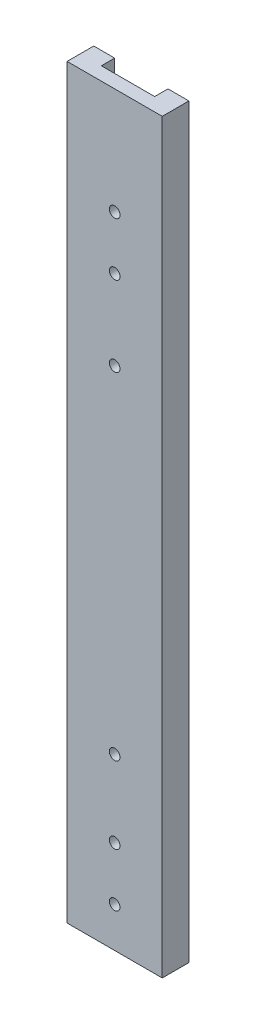
ISO-10303-21;
HEADER;
FILE_DESCRIPTION(('STEP AP214'),'2;1');
FILE_NAME('part.step','',(''),(''),'','','');
FILE_SCHEMA(('AUTOMOTIVE_DESIGN { 1 0 10303 214 1 1 1 1 }'));
ENDSEC;
DATA;
#1=APPLICATION_CONTEXT('core data for automotive mechanical design processes');
#2=APPLICATION_PROTOCOL_DEFINITION('international standard','automotive_design',2000,#1);
#3=PRODUCT_CONTEXT('',#1,'mechanical');
#4=PRODUCT('Part','Part','',(#3));
#5=PRODUCT_RELATED_PRODUCT_CATEGORY('part','',(#4));
#6=PRODUCT_DEFINITION_FORMATION('','',#4);
#7=PRODUCT_DEFINITION_CONTEXT('part definition',#1,'design');
#8=PRODUCT_DEFINITION('design','',#6,#7);
#9=PRODUCT_DEFINITION_SHAPE('','',#8);
#10=(LENGTH_UNIT() NAMED_UNIT(*) SI_UNIT(.MILLI.,.METRE.));
#11=(NAMED_UNIT(*) PLANE_ANGLE_UNIT() SI_UNIT($,.RADIAN.));
#12=(NAMED_UNIT(*) SI_UNIT($,.STERADIAN.) SOLID_ANGLE_UNIT());
#13=UNCERTAINTY_MEASURE_WITH_UNIT(LENGTH_MEASURE(1.E-05),#10,'distance_accuracy_value','');
#14=(GEOMETRIC_REPRESENTATION_CONTEXT(3) GLOBAL_UNCERTAINTY_ASSIGNED_CONTEXT((#13)) GLOBAL_UNIT_ASSIGNED_CONTEXT((#10,
#11,#12)) REPRESENTATION_CONTEXT('',''));
#15=CARTESIAN_POINT('',(0.,0.,0.));
#16=DIRECTION('',(0.,0.,1.));
#17=DIRECTION('',(1.,0.,0.));
#18=AXIS2_PLACEMENT_3D('',#15,#16,#17);
#19=CARTESIAN_POINT('',(0.,0.,0.));
#20=DIRECTION('',(0.,0.,-1.));
#21=DIRECTION('',(-1.,0.,0.));
#22=AXIS2_PLACEMENT_3D('',#19,#20,#21);
#23=PLANE('',#22);
#24=DIRECTION('',(0.,-1.,0.));
#25=VECTOR('',#24,1.);
#26=CARTESIAN_POINT('',(35.3695,0.,0.));
#27=LINE('',#26,#25);
#28=CARTESIAN_POINT('',(35.3695,355.6,0.));
#29=VERTEX_POINT('',#28);
#30=CARTESIAN_POINT('',(35.3695,0.,0.));
#31=VERTEX_POINT('',#30);
#32=EDGE_CURVE('E112',#29,#31,#27,.T.);
#33=ORIENTED_EDGE('',*,*,#32,.F.);
#34=DIRECTION('',(-1.,0.,0.));
#35=VECTOR('',#34,1.);
#36=CARTESIAN_POINT('',(0.,355.6,0.));
#37=LINE('',#36,#35);
#38=CARTESIAN_POINT('',(45.339,355.6,0.));
#39=VERTEX_POINT('',#38);
#40=EDGE_CURVE('E145',#39,#29,#37,.T.);
#41=ORIENTED_EDGE('',*,*,#40,.F.);
#42=DIRECTION('',(0.,1.,0.));
#43=VECTOR('',#42,1.);
#44=CARTESIAN_POINT('',(45.339,0.,0.));
#45=LINE('',#44,#43);
#46=CARTESIAN_POINT('',(45.339,0.,0.));
#47=VERTEX_POINT('',#46);
#48=EDGE_CURVE('E156',#47,#39,#45,.T.);
#49=ORIENTED_EDGE('',*,*,#48,.F.);
#50=DIRECTION('',(1.,0.,0.));
#51=VECTOR('',#50,1.);
#52=CARTESIAN_POINT('',(0.,0.,0.));
#53=LINE('',#52,#51);
#54=EDGE_CURVE('E153',#31,#47,#53,.T.);
#55=ORIENTED_EDGE('',*,*,#54,.F.);
#56=EDGE_LOOP('',(#33,#41,#49,#55));
#57=FACE_BOUND('',#56,.T.);
#58=ADVANCED_FACE('F33',(#57),#23,.T.);
#59=CARTESIAN_POINT('',(0.,0.,12.7));
#60=DIRECTION('',(1.,0.,0.));
#61=DIRECTION('',(0.,0.,-1.));
#62=AXIS2_PLACEMENT_3D('',#59,#60,#61);
#63=PLANE('',#62);
#64=DIRECTION('',(0.,-1.,0.));
#65=VECTOR('',#64,1.);
#66=CARTESIAN_POINT('',(0.,0.,0.));
#67=LINE('',#66,#65);
#68=CARTESIAN_POINT('',(0.,355.6,0.));
#69=VERTEX_POINT('',#68);
#70=CARTESIAN_POINT('',(0.,0.,0.));
#71=VERTEX_POINT('',#70);
#72=EDGE_CURVE('E139',#69,#71,#67,.T.);
#73=ORIENTED_EDGE('',*,*,#72,.T.);
#74=DIRECTION('',(0.,0.,-1.));
#75=VECTOR('',#74,1.);
#76=CARTESIAN_POINT('',(0.,0.,12.7));
#77=LINE('',#76,#75);
#78=CARTESIAN_POINT('',(0.,0.,12.7));
#79=VERTEX_POINT('',#78);
#80=EDGE_CURVE('E11',#79,#71,#77,.T.);
#81=ORIENTED_EDGE('',*,*,#80,.F.);
#82=DIRECTION('',(0.,-1.,0.));
#83=VECTOR('',#82,1.);
#84=CARTESIAN_POINT('',(0.,0.,12.7));
#85=LINE('',#84,#83);
#86=CARTESIAN_POINT('',(0.,355.6,12.7));
#87=VERTEX_POINT('',#86);
#88=EDGE_CURVE('E143',#87,#79,#85,.T.);
#89=ORIENTED_EDGE('',*,*,#88,.F.);
#90=DIRECTION('',(0.,0.,-1.));
#91=VECTOR('',#90,1.);
#92=CARTESIAN_POINT('',(0.,355.6,12.7));
#93=LINE('',#92,#91);
#94=EDGE_CURVE('E150',#87,#69,#93,.T.);
#95=ORIENTED_EDGE('',*,*,#94,.T.);
#96=EDGE_LOOP('',(#73,#81,#89,#95));
#97=FACE_BOUND('',#96,.T.);
#98=ADVANCED_FACE('F35',(#97),#63,.F.);
#99=CARTESIAN_POINT('',(0.,0.,12.7));
#100=DIRECTION('',(0.,1.,0.));
#101=DIRECTION('',(0.,0.,1.));
#102=AXIS2_PLACEMENT_3D('',#99,#100,#101);
#103=PLANE('',#102);
#104=DIRECTION('',(-1.,0.,0.));
#105=VECTOR('',#104,1.);
#106=CARTESIAN_POINT('',(9.9695,0.,6.35));
#107=LINE('',#106,#105);
#108=CARTESIAN_POINT('',(35.3695,0.,6.35));
#109=VERTEX_POINT('',#108);
#110=CARTESIAN_POINT('',(9.9695,0.,6.35));
#111=VERTEX_POINT('',#110);
#112=EDGE_CURVE('E121',#109,#111,#107,.T.);
#113=ORIENTED_EDGE('',*,*,#112,.F.);
#114=DIRECTION('',(0.,0.,-1.));
#115=VECTOR('',#114,1.);
#116=CARTESIAN_POINT('',(35.3695,0.,6.35));
#117=LINE('',#116,#115);
#118=EDGE_CURVE('E106',#109,#31,#117,.T.);
#119=ORIENTED_EDGE('',*,*,#118,.T.);
#120=ORIENTED_EDGE('',*,*,#54,.T.);
#121=DIRECTION('',(0.,0.,-1.));
#122=VECTOR('',#121,1.);
#123=CARTESIAN_POINT('',(45.339,0.,12.7));
#124=LINE('',#123,#122);
#125=CARTESIAN_POINT('',(45.339,0.,12.7));
#126=VERTEX_POINT('',#125);
#127=EDGE_CURVE('E41',#126,#47,#124,.T.);
#128=ORIENTED_EDGE('',*,*,#127,.F.);
#129=DIRECTION('',(1.,0.,0.));
#130=VECTOR('',#129,1.);
#131=CARTESIAN_POINT('',(0.,0.,12.7));
#132=LINE('',#131,#130);
#133=EDGE_CURVE('E85',#79,#126,#132,.T.);
#134=ORIENTED_EDGE('',*,*,#133,.F.);
#135=ORIENTED_EDGE('',*,*,#80,.T.);
#136=CARTESIAN_POINT('',(9.9695,0.,0.));
#137=VERTEX_POINT('',#136);
#138=EDGE_CURVE('E154',#71,#137,#53,.T.);
#139=ORIENTED_EDGE('',*,*,#138,.T.);
#140=DIRECTION('',(0.,0.,-1.));
#141=VECTOR('',#140,1.);
#142=CARTESIAN_POINT('',(9.9695,0.,6.35));
#143=LINE('',#142,#141);
#144=EDGE_CURVE('E48',#111,#137,#143,.T.);
#145=ORIENTED_EDGE('',*,*,#144,.F.);
#146=EDGE_LOOP('',(#113,#119,#120,#128,#134,#135,#139,#145));
#147=FACE_BOUND('',#146,.T.);
#148=ADVANCED_FACE('F126',(#147),#103,.F.);
#149=CARTESIAN_POINT('',(45.339,0.,12.7));
#150=DIRECTION('',(-1.,0.,0.));
#151=DIRECTION('',(0.,0.,1.));
#152=AXIS2_PLACEMENT_3D('',#149,#150,#151);
#153=PLANE('',#152);
#154=ORIENTED_EDGE('',*,*,#48,.T.);
#155=DIRECTION('',(0.,0.,-1.));
#156=VECTOR('',#155,1.);
#157=CARTESIAN_POINT('',(45.339,355.6,12.7));
#158=LINE('',#157,#156);
#159=CARTESIAN_POINT('',(45.339,355.6,12.7));
#160=VERTEX_POINT('',#159);
#161=EDGE_CURVE('E161',#160,#39,#158,.T.);
#162=ORIENTED_EDGE('',*,*,#161,.F.);
#163=DIRECTION('',(0.,1.,0.));
#164=VECTOR('',#163,1.);
#165=CARTESIAN_POINT('',(45.339,0.,12.7));
#166=LINE('',#165,#164);
#167=EDGE_CURVE('E147',#126,#160,#166,.T.);
#168=ORIENTED_EDGE('',*,*,#167,.F.);
#169=ORIENTED_EDGE('',*,*,#127,.T.);
#170=EDGE_LOOP('',(#154,#162,#168,#169));
#171=FACE_BOUND('',#170,.T.);
#172=ADVANCED_FACE('F167',(#171),#153,.F.);
#173=CARTESIAN_POINT('',(0.,355.6,12.7));
#174=DIRECTION('',(0.,-1.,0.));
#175=DIRECTION('',(0.,0.,-1.));
#176=AXIS2_PLACEMENT_3D('',#173,#174,#175);
#177=PLANE('',#176);
#178=ORIENTED_EDGE('',*,*,#40,.T.);
#179=DIRECTION('',(0.,0.,-1.));
#180=VECTOR('',#179,1.);
#181=CARTESIAN_POINT('',(35.3695,355.6,6.35));
#182=LINE('',#181,#180);
#183=CARTESIAN_POINT('',(35.3695,355.6,6.35));
#184=VERTEX_POINT('',#183);
#185=EDGE_CURVE('E137',#184,#29,#182,.T.);
#186=ORIENTED_EDGE('',*,*,#185,.F.);
#187=DIRECTION('',(1.,0.,0.));
#188=VECTOR('',#187,1.);
#189=CARTESIAN_POINT('',(9.9695,355.6,6.35));
#190=LINE('',#189,#188);
#191=CARTESIAN_POINT('',(9.9695,355.6,6.35));
#192=VERTEX_POINT('',#191);
#193=EDGE_CURVE('E115',#192,#184,#190,.T.);
#194=ORIENTED_EDGE('',*,*,#193,.F.);
#195=DIRECTION('',(0.,0.,-1.));
#196=VECTOR('',#195,1.);
#197=CARTESIAN_POINT('',(9.9695,355.6,6.35));
#198=LINE('',#197,#196);
#199=CARTESIAN_POINT('',(9.9695,355.6,0.));
#200=VERTEX_POINT('',#199);
#201=EDGE_CURVE('E140',#192,#200,#198,.T.);
#202=ORIENTED_EDGE('',*,*,#201,.T.);
#203=EDGE_CURVE('E78',#200,#69,#37,.T.);
#204=ORIENTED_EDGE('',*,*,#203,.T.);
#205=ORIENTED_EDGE('',*,*,#94,.F.);
#206=DIRECTION('',(-1.,0.,0.));
#207=VECTOR('',#206,1.);
#208=CARTESIAN_POINT('',(0.,355.6,12.7));
#209=LINE('',#208,#207);
#210=EDGE_CURVE('E57',#160,#87,#209,.T.);
#211=ORIENTED_EDGE('',*,*,#210,.F.);
#212=ORIENTED_EDGE('',*,*,#161,.T.);
#213=EDGE_LOOP('',(#178,#186,#194,#202,#204,#205,#211,#212));
#214=FACE_BOUND('',#213,.T.);
#215=ADVANCED_FACE('F171',(#214),#177,.F.);
#216=CARTESIAN_POINT('',(0.,0.,12.7));
#217=DIRECTION('',(0.,0.,-1.));
#218=DIRECTION('',(-1.,0.,0.));
#219=AXIS2_PLACEMENT_3D('',#216,#217,#218);
#220=PLANE('',#219);
#221=CARTESIAN_POINT('',(22.6695,80.9625,12.7));
#222=DIRECTION('',(0.,0.,-1.));
#223=DIRECTION('',(-1.,0.,0.));
#224=AXIS2_PLACEMENT_3D('',#221,#222,#223);
#225=CIRCLE('',#224,2.54);
#226=CARTESIAN_POINT('',(20.1295,80.9625,12.7));
#227=VERTEX_POINT('',#226);
#228=EDGE_CURVE('E312',#227,#227,#225,.T.);
#229=ORIENTED_EDGE('',*,*,#228,.T.);
#230=EDGE_LOOP('',(#229));
#231=FACE_BOUND('',#230,.T.);
#232=CARTESIAN_POINT('',(22.6695,241.3,12.7));
#233=DIRECTION('',(0.,0.,-1.));
#234=DIRECTION('',(-1.,0.,0.));
#235=AXIS2_PLACEMENT_3D('',#232,#233,#234);
#236=CIRCLE('',#235,2.54);
#237=CARTESIAN_POINT('',(20.1295,241.3,12.7));
#238=VERTEX_POINT('',#237);
#239=EDGE_CURVE('E320',#238,#238,#236,.T.);
#240=ORIENTED_EDGE('',*,*,#239,.T.);
#241=EDGE_LOOP('',(#240));
#242=FACE_BOUND('',#241,.T.);
#243=CARTESIAN_POINT('',(22.6695,279.4,12.7));
#244=DIRECTION('',(0.,0.,-1.));
#245=DIRECTION('',(-1.,0.,0.));
#246=AXIS2_PLACEMENT_3D('',#243,#244,#245);
#247=CIRCLE('',#246,2.54);
#248=CARTESIAN_POINT('',(20.1295,279.4,12.7));
#249=VERTEX_POINT('',#248);
#250=EDGE_CURVE('E326',#249,#249,#247,.T.);
#251=ORIENTED_EDGE('',*,*,#250,.T.);
#252=EDGE_LOOP('',(#251));
#253=FACE_BOUND('',#252,.T.);
#254=CARTESIAN_POINT('',(22.6695,304.8,12.7));
#255=DIRECTION('',(0.,0.,-1.));
#256=DIRECTION('',(-1.,0.,0.));
#257=AXIS2_PLACEMENT_3D('',#254,#255,#256);
#258=CIRCLE('',#257,2.54);
#259=CARTESIAN_POINT('',(20.1295,304.8,12.7));
#260=VERTEX_POINT('',#259);
#261=EDGE_CURVE('E332',#260,#260,#258,.T.);
#262=ORIENTED_EDGE('',*,*,#261,.T.);
#263=EDGE_LOOP('',(#262));
#264=FACE_BOUND('',#263,.T.);
#265=CARTESIAN_POINT('',(22.6695,44.45,12.7));
#266=DIRECTION('',(0.,0.,-1.));
#267=DIRECTION('',(-1.,0.,0.));
#268=AXIS2_PLACEMENT_3D('',#265,#266,#267);
#269=CIRCLE('',#268,2.54);
#270=CARTESIAN_POINT('',(20.1295,44.45,12.7));
#271=VERTEX_POINT('',#270);
#272=EDGE_CURVE('E338',#271,#271,#269,.T.);
#273=ORIENTED_EDGE('',*,*,#272,.T.);
#274=EDGE_LOOP('',(#273));
#275=FACE_BOUND('',#274,.T.);
#276=CARTESIAN_POINT('',(22.6695,19.05,12.7));
#277=DIRECTION('',(0.,0.,-1.));
#278=DIRECTION('',(-1.,0.,0.));
#279=AXIS2_PLACEMENT_3D('',#276,#277,#278);
#280=CIRCLE('',#279,2.54);
#281=CARTESIAN_POINT('',(20.1295,19.05,12.7));
#282=VERTEX_POINT('',#281);
#283=EDGE_CURVE('E135',#282,#282,#280,.T.);
#284=ORIENTED_EDGE('',*,*,#283,.T.);
#285=EDGE_LOOP('',(#284));
#286=FACE_BOUND('',#285,.T.);
#287=ORIENTED_EDGE('',*,*,#88,.T.);
#288=ORIENTED_EDGE('',*,*,#133,.T.);
#289=ORIENTED_EDGE('',*,*,#167,.T.);
#290=ORIENTED_EDGE('',*,*,#210,.T.);
#291=EDGE_LOOP('',(#287,#288,#289,#290));
#292=FACE_BOUND('',#291,.T.);
#293=ADVANCED_FACE('F176',(#231,#242,#253,#264,#275,#286,#292),#220,.F.);
#294=DIRECTION('',(0.,1.,0.));
#295=VECTOR('',#294,1.);
#296=CARTESIAN_POINT('',(9.9695,0.,0.));
#297=LINE('',#296,#295);
#298=EDGE_CURVE('E124',#137,#200,#297,.T.);
#299=ORIENTED_EDGE('',*,*,#298,.F.);
#300=ORIENTED_EDGE('',*,*,#138,.F.);
#301=ORIENTED_EDGE('',*,*,#72,.F.);
#302=ORIENTED_EDGE('',*,*,#203,.F.);
#303=EDGE_LOOP('',(#299,#300,#301,#302));
#304=FACE_BOUND('',#303,.T.);
#305=ADVANCED_FACE('F178',(#304),#23,.T.);
#306=CARTESIAN_POINT('',(35.3695,0.,6.35));
#307=DIRECTION('',(1.,0.,0.));
#308=DIRECTION('',(0.,0.,-1.));
#309=AXIS2_PLACEMENT_3D('',#306,#307,#308);
#310=PLANE('',#309);
#311=ORIENTED_EDGE('',*,*,#32,.T.);
#312=ORIENTED_EDGE('',*,*,#118,.F.);
#313=DIRECTION('',(0.,-1.,0.));
#314=VECTOR('',#313,1.);
#315=CARTESIAN_POINT('',(35.3695,0.,6.35));
#316=LINE('',#315,#314);
#317=EDGE_CURVE('E109',#184,#109,#316,.T.);
#318=ORIENTED_EDGE('',*,*,#317,.F.);
#319=ORIENTED_EDGE('',*,*,#185,.T.);
#320=EDGE_LOOP('',(#311,#312,#318,#319));
#321=FACE_BOUND('',#320,.T.);
#322=ADVANCED_FACE('F108',(#321),#310,.F.);
#323=CARTESIAN_POINT('',(9.9695,0.,6.35));
#324=DIRECTION('',(-1.,0.,0.));
#325=DIRECTION('',(0.,0.,1.));
#326=AXIS2_PLACEMENT_3D('',#323,#324,#325);
#327=PLANE('',#326);
#328=ORIENTED_EDGE('',*,*,#298,.T.);
#329=ORIENTED_EDGE('',*,*,#201,.F.);
#330=DIRECTION('',(0.,1.,0.));
#331=VECTOR('',#330,1.);
#332=CARTESIAN_POINT('',(9.9695,0.,6.35));
#333=LINE('',#332,#331);
#334=EDGE_CURVE('E128',#111,#192,#333,.T.);
#335=ORIENTED_EDGE('',*,*,#334,.F.);
#336=ORIENTED_EDGE('',*,*,#144,.T.);
#337=EDGE_LOOP('',(#328,#329,#335,#336));
#338=FACE_BOUND('',#337,.T.);
#339=ADVANCED_FACE('F227',(#338),#327,.F.);
#340=CARTESIAN_POINT('',(0.,0.,6.35));
#341=DIRECTION('',(0.,0.,-1.));
#342=DIRECTION('',(-1.,0.,0.));
#343=AXIS2_PLACEMENT_3D('',#340,#341,#342);
#344=PLANE('',#343);
#345=CARTESIAN_POINT('',(22.6695,80.9625,6.35));
#346=DIRECTION('',(0.,0.,-1.));
#347=DIRECTION('',(-1.,0.,0.));
#348=AXIS2_PLACEMENT_3D('',#345,#346,#347);
#349=CIRCLE('',#348,2.54);
#350=CARTESIAN_POINT('',(20.1295,80.9625,6.35));
#351=VERTEX_POINT('',#350);
#352=EDGE_CURVE('E315',#351,#351,#349,.T.);
#353=ORIENTED_EDGE('',*,*,#352,.F.);
#354=EDGE_LOOP('',(#353));
#355=FACE_BOUND('',#354,.T.);
#356=CARTESIAN_POINT('',(22.6695,241.3,6.35));
#357=DIRECTION('',(0.,0.,-1.));
#358=DIRECTION('',(-1.,0.,0.));
#359=AXIS2_PLACEMENT_3D('',#356,#357,#358);
#360=CIRCLE('',#359,2.54);
#361=CARTESIAN_POINT('',(20.1295,241.3,6.35));
#362=VERTEX_POINT('',#361);
#363=EDGE_CURVE('E317',#362,#362,#360,.T.);
#364=ORIENTED_EDGE('',*,*,#363,.F.);
#365=EDGE_LOOP('',(#364));
#366=FACE_BOUND('',#365,.T.);
#367=CARTESIAN_POINT('',(22.6695,279.4,6.35));
#368=DIRECTION('',(0.,0.,-1.));
#369=DIRECTION('',(-1.,0.,0.));
#370=AXIS2_PLACEMENT_3D('',#367,#368,#369);
#371=CIRCLE('',#370,2.54);
#372=CARTESIAN_POINT('',(20.1295,279.4,6.35));
#373=VERTEX_POINT('',#372);
#374=EDGE_CURVE('E323',#373,#373,#371,.T.);
#375=ORIENTED_EDGE('',*,*,#374,.F.);
#376=EDGE_LOOP('',(#375));
#377=FACE_BOUND('',#376,.T.);
#378=CARTESIAN_POINT('',(22.6695,304.8,6.35));
#379=DIRECTION('',(0.,0.,-1.));
#380=DIRECTION('',(-1.,0.,0.));
#381=AXIS2_PLACEMENT_3D('',#378,#379,#380);
#382=CIRCLE('',#381,2.54);
#383=CARTESIAN_POINT('',(20.1295,304.8,6.35));
#384=VERTEX_POINT('',#383);
#385=EDGE_CURVE('E329',#384,#384,#382,.T.);
#386=ORIENTED_EDGE('',*,*,#385,.F.);
#387=EDGE_LOOP('',(#386));
#388=FACE_BOUND('',#387,.T.);
#389=CARTESIAN_POINT('',(22.6695,44.45,6.35));
#390=DIRECTION('',(0.,0.,-1.));
#391=DIRECTION('',(-1.,0.,0.));
#392=AXIS2_PLACEMENT_3D('',#389,#390,#391);
#393=CIRCLE('',#392,2.54);
#394=CARTESIAN_POINT('',(20.1295,44.45,6.35));
#395=VERTEX_POINT('',#394);
#396=EDGE_CURVE('E335',#395,#395,#393,.T.);
#397=ORIENTED_EDGE('',*,*,#396,.F.);
#398=EDGE_LOOP('',(#397));
#399=FACE_BOUND('',#398,.T.);
#400=CARTESIAN_POINT('',(22.6695,19.05,6.35));
#401=DIRECTION('',(0.,0.,-1.));
#402=DIRECTION('',(-1.,0.,0.));
#403=AXIS2_PLACEMENT_3D('',#400,#401,#402);
#404=CIRCLE('',#403,2.54);
#405=CARTESIAN_POINT('',(20.1295,19.05,6.35));
#406=VERTEX_POINT('',#405);
#407=EDGE_CURVE('E341',#406,#406,#404,.T.);
#408=ORIENTED_EDGE('',*,*,#407,.F.);
#409=EDGE_LOOP('',(#408));
#410=FACE_BOUND('',#409,.T.);
#411=ORIENTED_EDGE('',*,*,#317,.T.);
#412=ORIENTED_EDGE('',*,*,#112,.T.);
#413=ORIENTED_EDGE('',*,*,#334,.T.);
#414=ORIENTED_EDGE('',*,*,#193,.T.);
#415=EDGE_LOOP('',(#411,#412,#413,#414));
#416=FACE_BOUND('',#415,.T.);
#417=ADVANCED_FACE('F119',(#355,#366,#377,#388,#399,#410,#416),#344,.T.);
#418=CARTESIAN_POINT('',(22.6695,19.05,12.7));
#419=DIRECTION('',(0.,0.,-1.));
#420=DIRECTION('',(-1.,0.,0.));
#421=AXIS2_PLACEMENT_3D('',#418,#419,#420);
#422=CYLINDRICAL_SURFACE('',#421,2.54);
#423=ORIENTED_EDGE('',*,*,#283,.F.);
#424=EDGE_LOOP('',(#423));
#425=FACE_BOUND('',#424,.T.);
#426=ORIENTED_EDGE('',*,*,#407,.T.);
#427=EDGE_LOOP('',(#426));
#428=FACE_BOUND('',#427,.T.);
#429=ADVANCED_FACE('F246',(#425,#428),#422,.F.);
#430=CARTESIAN_POINT('',(22.6695,44.45,12.7));
#431=DIRECTION('',(0.,0.,-1.));
#432=DIRECTION('',(-1.,0.,0.));
#433=AXIS2_PLACEMENT_3D('',#430,#431,#432);
#434=CYLINDRICAL_SURFACE('',#433,2.54);
#435=ORIENTED_EDGE('',*,*,#272,.F.);
#436=EDGE_LOOP('',(#435));
#437=FACE_BOUND('',#436,.T.);
#438=ORIENTED_EDGE('',*,*,#396,.T.);
#439=EDGE_LOOP('',(#438));
#440=FACE_BOUND('',#439,.T.);
#441=ADVANCED_FACE('F256',(#437,#440),#434,.F.);
#442=CARTESIAN_POINT('',(22.6695,304.8,12.7));
#443=DIRECTION('',(0.,0.,-1.));
#444=DIRECTION('',(-1.,0.,0.));
#445=AXIS2_PLACEMENT_3D('',#442,#443,#444);
#446=CYLINDRICAL_SURFACE('',#445,2.54);
#447=ORIENTED_EDGE('',*,*,#261,.F.);
#448=EDGE_LOOP('',(#447));
#449=FACE_BOUND('',#448,.T.);
#450=ORIENTED_EDGE('',*,*,#385,.T.);
#451=EDGE_LOOP('',(#450));
#452=FACE_BOUND('',#451,.T.);
#453=ADVANCED_FACE('F266',(#449,#452),#446,.F.);
#454=CARTESIAN_POINT('',(22.6695,279.4,12.7));
#455=DIRECTION('',(0.,0.,-1.));
#456=DIRECTION('',(-1.,0.,0.));
#457=AXIS2_PLACEMENT_3D('',#454,#455,#456);
#458=CYLINDRICAL_SURFACE('',#457,2.54);
#459=ORIENTED_EDGE('',*,*,#250,.F.);
#460=EDGE_LOOP('',(#459));
#461=FACE_BOUND('',#460,.T.);
#462=ORIENTED_EDGE('',*,*,#374,.T.);
#463=EDGE_LOOP('',(#462));
#464=FACE_BOUND('',#463,.T.);
#465=ADVANCED_FACE('F276',(#461,#464),#458,.F.);
#466=CARTESIAN_POINT('',(22.6695,241.3,12.7));
#467=DIRECTION('',(0.,0.,-1.));
#468=DIRECTION('',(-1.,0.,0.));
#469=AXIS2_PLACEMENT_3D('',#466,#467,#468);
#470=CYLINDRICAL_SURFACE('',#469,2.54);
#471=ORIENTED_EDGE('',*,*,#239,.F.);
#472=EDGE_LOOP('',(#471));
#473=FACE_BOUND('',#472,.T.);
#474=ORIENTED_EDGE('',*,*,#363,.T.);
#475=EDGE_LOOP('',(#474));
#476=FACE_BOUND('',#475,.T.);
#477=ADVANCED_FACE('F286',(#473,#476),#470,.F.);
#478=CARTESIAN_POINT('',(22.6695,80.9625,12.7));
#479=DIRECTION('',(0.,0.,-1.));
#480=DIRECTION('',(-1.,0.,0.));
#481=AXIS2_PLACEMENT_3D('',#478,#479,#480);
#482=CYLINDRICAL_SURFACE('',#481,2.54);
#483=ORIENTED_EDGE('',*,*,#228,.F.);
#484=EDGE_LOOP('',(#483));
#485=FACE_BOUND('',#484,.T.);
#486=ORIENTED_EDGE('',*,*,#352,.T.);
#487=EDGE_LOOP('',(#486));
#488=FACE_BOUND('',#487,.T.);
#489=ADVANCED_FACE('F296',(#485,#488),#482,.F.);
#490=CLOSED_SHELL('',(#58,#98,#148,#172,#215,#293,#305,#322,#339,#417,#429,#441,#453,#465,#477,#489));
#491=MANIFOLD_SOLID_BREP('B2',#490);
#492=ADVANCED_BREP_SHAPE_REPRESENTATION('',(#18,#491),#14);
#493=SHAPE_DEFINITION_REPRESENTATION(#9,#492);
ENDSEC;
END-ISO-10303-21;
